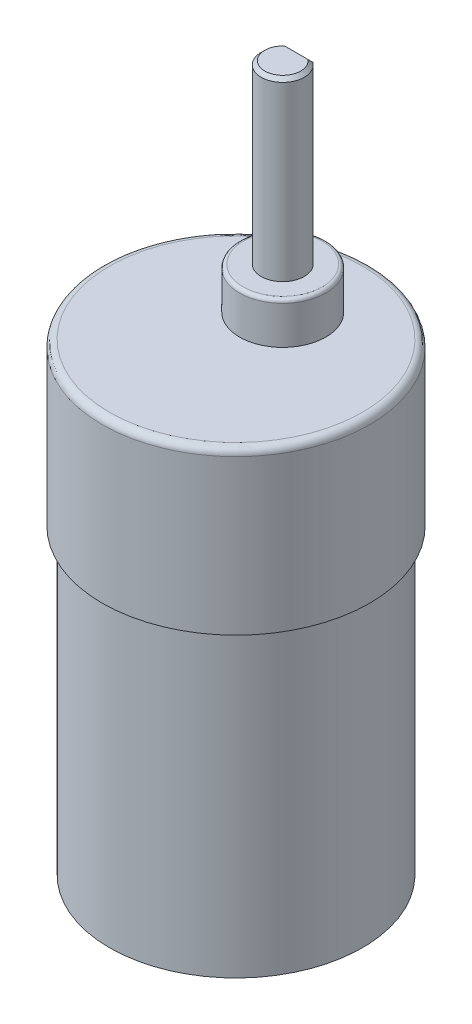
ISO-10303-21;
HEADER;
FILE_DESCRIPTION(('STEP AP214'),'2;1');
FILE_NAME('part.step','',(''),(''),'','','');
FILE_SCHEMA(('AUTOMOTIVE_DESIGN { 1 0 10303 214 1 1 1 1 }'));
ENDSEC;
DATA;
#1=APPLICATION_CONTEXT('core data for automotive mechanical design processes');
#2=APPLICATION_PROTOCOL_DEFINITION('international standard','automotive_design',2000,#1);
#3=PRODUCT_CONTEXT('',#1,'mechanical');
#4=PRODUCT('Part','Part','',(#3));
#5=PRODUCT_RELATED_PRODUCT_CATEGORY('part','',(#4));
#6=PRODUCT_DEFINITION_FORMATION('','',#4);
#7=PRODUCT_DEFINITION_CONTEXT('part definition',#1,'design');
#8=PRODUCT_DEFINITION('design','',#6,#7);
#9=PRODUCT_DEFINITION_SHAPE('','',#8);
#10=(LENGTH_UNIT() NAMED_UNIT(*) SI_UNIT(.MILLI.,.METRE.));
#11=(NAMED_UNIT(*) PLANE_ANGLE_UNIT() SI_UNIT($,.RADIAN.));
#12=(NAMED_UNIT(*) SI_UNIT($,.STERADIAN.) SOLID_ANGLE_UNIT());
#13=UNCERTAINTY_MEASURE_WITH_UNIT(LENGTH_MEASURE(1.E-05),#10,'distance_accuracy_value','');
#14=(GEOMETRIC_REPRESENTATION_CONTEXT(3) GLOBAL_UNCERTAINTY_ASSIGNED_CONTEXT((#13)) GLOBAL_UNIT_ASSIGNED_CONTEXT((#10,
#11,#12)) REPRESENTATION_CONTEXT('',''));
#15=CARTESIAN_POINT('',(0.,0.,0.));
#16=DIRECTION('',(0.,0.,1.));
#17=DIRECTION('',(1.,0.,0.));
#18=AXIS2_PLACEMENT_3D('',#15,#16,#17);
#19=CARTESIAN_POINT('',(0.,28.3,-6.5));
#20=DIRECTION('',(0.,1.,0.));
#21=DIRECTION('',(0.,0.,1.));
#22=AXIS2_PLACEMENT_3D('',#19,#20,#21);
#23=PLANE('',#22);
#24=CARTESIAN_POINT('',(0.,28.3,-6.5));
#25=DIRECTION('',(0.,-1.,0.));
#26=DIRECTION('',(0.,0.,1.));
#27=AXIS2_PLACEMENT_3D('',#24,#25,#26);
#28=CIRCLE('',#27,5.5);
#29=CARTESIAN_POINT('',(0.,28.3,-0.999999999999998));
#30=VERTEX_POINT('',#29);
#31=EDGE_CURVE('P0_E199',#30,#30,#28,.T.);
#32=ORIENTED_EDGE('',*,*,#31,.F.);
#33=EDGE_LOOP('',(#32));
#34=FACE_BOUND('',#33,.T.);
#35=ADVANCED_FACE('P0_F15',(#34),#23,.T.);
#36=CARTESIAN_POINT('',(0.,-44.7,0.));
#37=DIRECTION('',(0.,-1.,0.));
#38=DIRECTION('',(0.,0.,-1.));
#39=AXIS2_PLACEMENT_3D('',#36,#37,#38);
#40=PLANE('',#39);
#41=CARTESIAN_POINT('',(0.,-44.7,0.));
#42=DIRECTION('',(0.,1.,0.));
#43=DIRECTION('',(0.,0.,-1.));
#44=AXIS2_PLACEMENT_3D('',#41,#42,#43);
#45=CIRCLE('',#44,2.9);
#46=CARTESIAN_POINT('',(0.,-44.7,-2.9));
#47=VERTEX_POINT('',#46);
#48=EDGE_CURVE('P0_E168',#47,#47,#45,.T.);
#49=ORIENTED_EDGE('',*,*,#48,.F.);
#50=EDGE_LOOP('',(#49));
#51=FACE_BOUND('',#50,.T.);
#52=ADVANCED_FACE('P0_F598',(#51),#40,.T.);
#53=CARTESIAN_POINT('',(0.,27.8,-6.5));
#54=DIRECTION('',(0.,1.,0.));
#55=DIRECTION('',(0.,0.,1.));
#56=AXIS2_PLACEMENT_3D('',#53,#54,#55);
#57=TOROIDAL_SURFACE('',#56,5.5,0.5);
#58=ORIENTED_EDGE('',*,*,#31,.T.);
#59=EDGE_LOOP('',(#58));
#60=FACE_BOUND('',#59,.T.);
#61=CARTESIAN_POINT('',(0.,27.8,-6.5));
#62=DIRECTION('',(0.,-1.,0.));
#63=DIRECTION('',(0.,0.,-1.));
#64=AXIS2_PLACEMENT_3D('',#61,#62,#63);
#65=CIRCLE('',#64,6.);
#66=CARTESIAN_POINT('',(0.,27.8,-12.5));
#67=VERTEX_POINT('',#66);
#68=EDGE_CURVE('P0_E139',#67,#67,#65,.T.);
#69=ORIENTED_EDGE('',*,*,#68,.F.);
#70=EDGE_LOOP('',(#69));
#71=FACE_BOUND('',#70,.T.);
#72=ADVANCED_FACE('P0_F179',(#60,#71),#57,.T.);
#73=CARTESIAN_POINT('',(0.,-42.7,0.));
#74=DIRECTION('',(0.,-1.,0.));
#75=DIRECTION('',(0.,0.,-1.));
#76=AXIS2_PLACEMENT_3D('',#73,#74,#75);
#77=TOROIDAL_SURFACE('',#76,2.9,2.);
#78=ORIENTED_EDGE('',*,*,#48,.T.);
#79=EDGE_LOOP('',(#78));
#80=FACE_BOUND('',#79,.T.);
#81=CARTESIAN_POINT('',(0.,-42.7,0.));
#82=DIRECTION('',(0.,1.,0.));
#83=DIRECTION('',(0.,0.,1.));
#84=AXIS2_PLACEMENT_3D('',#81,#82,#83);
#85=CIRCLE('',#84,4.9);
#86=CARTESIAN_POINT('',(0.,-42.7,4.9));
#87=VERTEX_POINT('',#86);
#88=EDGE_CURVE('P0_E123',#87,#87,#85,.T.);
#89=ORIENTED_EDGE('',*,*,#88,.F.);
#90=EDGE_LOOP('',(#89));
#91=FACE_BOUND('',#90,.T.);
#92=ADVANCED_FACE('P0_F174',(#80,#91),#77,.T.);
#93=CARTESIAN_POINT('',(9.50016722103489,-46.,-9.6182094503272));
#94=DIRECTION('',(-0.363581099345543,0.,0.931562549804728));
#95=DIRECTION('',(0.931562549804728,0.,0.363581099345543));
#96=AXIS2_PLACEMENT_3D('',#93,#94,#95);
#97=PLANE('',#96);
#98=DIRECTION('',(-0.931562549804728,0.,-0.363581099345544));
#99=VECTOR('',#98,1.);
#100=CARTESIAN_POINT('',(9.50016722103489,-45.5,-9.6182094503272));
#101=LINE('',#100,#99);
#102=CARTESIAN_POINT('',(9.50016722103489,-45.5,-9.6182094503272));
#103=VERTEX_POINT('',#102);
#104=CARTESIAN_POINT('',(9.03438594613245,-45.5,-9.8));
#105=VERTEX_POINT('',#104);
#106=EDGE_CURVE('P0_E108',#103,#105,#101,.T.);
#107=ORIENTED_EDGE('',*,*,#106,.T.);
#108=DIRECTION('',(0.,1.,0.));
#109=VECTOR('',#108,1.);
#110=CARTESIAN_POINT('',(9.03438594613245,-46.,-9.8));
#111=LINE('',#110,#109);
#112=CARTESIAN_POINT('',(9.03438594613245,-41.,-9.8));
#113=VERTEX_POINT('',#112);
#114=EDGE_CURVE('P0_E111',#105,#113,#111,.T.);
#115=ORIENTED_EDGE('',*,*,#114,.T.);
#116=DIRECTION('',(0.931562549804728,0.,0.363581099345543));
#117=VECTOR('',#116,1.);
#118=CARTESIAN_POINT('',(9.50016722103489,-41.,-9.6182094503272));
#119=LINE('',#118,#117);
#120=CARTESIAN_POINT('',(9.50016722103489,-41.,-9.6182094503272));
#121=VERTEX_POINT('',#120);
#122=EDGE_CURVE('P0_E116',#121,#113,#119,.F.);
#123=ORIENTED_EDGE('',*,*,#122,.F.);
#124=DIRECTION('',(0.,1.,0.));
#125=VECTOR('',#124,1.);
#126=CARTESIAN_POINT('',(9.50016722103489,-46.,-9.6182094503272));
#127=LINE('',#126,#125);
#128=EDGE_CURVE('P0_E114',#121,#103,#127,.F.);
#129=ORIENTED_EDGE('',*,*,#128,.T.);
#130=EDGE_LOOP('',(#107,#115,#123,#129));
#131=FACE_BOUND('',#130,.T.);
#132=ADVANCED_FACE('P0_F109',(#131),#97,.F.);
#133=CARTESIAN_POINT('',(8.8525953964609,-46.,-9.33421872509717));
#134=DIRECTION('',(-0.257090660858496,0.707106781186542,0.65871419606636));
#135=DIRECTION('',(0.,-0.681625476296494,0.731701243721491));
#136=AXIS2_PLACEMENT_3D('',#133,#134,#135);
#137=PLANE('',#136);
#138=ORIENTED_EDGE('',*,*,#106,.F.);
#139=DIRECTION('',(-0.257090660858222,-0.707106781186555,0.658714196066452));
#140=VECTOR('',#139,1.);
#141=CARTESIAN_POINT('',(9.50016722103489,-45.5,-9.6182094503272));
#142=LINE('',#141,#140);
#143=CARTESIAN_POINT('',(9.31837667136231,-46.,-9.15242817542477));
#144=VERTEX_POINT('',#143);
#145=EDGE_CURVE('P0_E266',#103,#144,#142,.T.);
#146=ORIENTED_EDGE('',*,*,#145,.T.);
#147=DIRECTION('',(-0.931562549804734,0.,-0.363581099345529));
#148=VECTOR('',#147,1.);
#149=CARTESIAN_POINT('',(9.31837667136231,-46.,-9.15242817542477));
#150=LINE('',#149,#148);
#151=CARTESIAN_POINT('',(8.85259539645988,-46.,-9.33421872509756));
#152=VERTEX_POINT('',#151);
#153=EDGE_CURVE('P0_E102',#144,#152,#150,.T.);
#154=ORIENTED_EDGE('',*,*,#153,.T.);
#155=DIRECTION('',(0.257090660858207,0.707106781186549,-0.658714196066464));
#156=VECTOR('',#155,1.);
#157=CARTESIAN_POINT('',(8.85259539645988,-46.,-9.33421872509756));
#158=LINE('',#157,#156);
#159=EDGE_CURVE('P0_E119',#152,#105,#158,.T.);
#160=ORIENTED_EDGE('',*,*,#159,.T.);
#161=EDGE_LOOP('',(#138,#146,#154,#160));
#162=FACE_BOUND('',#161,.T.);
#163=ADVANCED_FACE('P0_F120',(#162),#137,.F.);
#164=CARTESIAN_POINT('',(7.94364264809696,-46.,-7.00531235058515));
#165=DIRECTION('',(0.,1.,0.));
#166=DIRECTION('',(0.,0.,1.));
#167=AXIS2_PLACEMENT_3D('',#164,#165,#166);
#168=PLANE('',#167);
#169=DIRECTION('',(-0.931562549804876,0.,-0.363581099345163));
#170=VECTOR('',#169,1.);
#171=CARTESIAN_POINT('',(8.59121447267197,-46.,-7.28930307581499));
#172=LINE('',#171,#170);
#173=CARTESIAN_POINT('',(8.59121447267197,-46.,-7.28930307581499));
#174=VERTEX_POINT('',#173);
#175=CARTESIAN_POINT('',(8.12543319776952,-46.,-7.47109362548758));
#176=VERTEX_POINT('',#175);
#177=EDGE_CURVE('P0_E164',#174,#176,#172,.T.);
#178=ORIENTED_EDGE('',*,*,#177,.T.);
#179=DIRECTION('',(0.363581099345139,0.,-0.931562549804886));
#180=VECTOR('',#179,1.);
#181=CARTESIAN_POINT('',(9.03438594613245,-46.,-9.8));
#182=LINE('',#181,#180);
#183=EDGE_CURVE('P0_E269',#176,#152,#182,.T.);
#184=ORIENTED_EDGE('',*,*,#183,.T.);
#185=ORIENTED_EDGE('',*,*,#153,.F.);
#186=DIRECTION('',(-0.363581099345163,0.,0.931562549804876));
#187=VECTOR('',#186,1.);
#188=CARTESIAN_POINT('',(8.4094239229994,-46.,-6.82352180091257));
#189=LINE('',#188,#187);
#190=EDGE_CURVE('P0_E261',#144,#174,#189,.T.);
#191=ORIENTED_EDGE('',*,*,#190,.T.);
#192=EDGE_LOOP('',(#178,#184,#185,#191));
#193=FACE_BOUND('',#192,.T.);
#194=ADVANCED_FACE('P0_F276',(#193),#168,.F.);
#195=CARTESIAN_POINT('',(8.12543319776954,-46.,-7.47109362548757));
#196=DIRECTION('',(0.257090660858227,0.707106781186538,-0.658714196066469));
#197=DIRECTION('',(0.,0.681625476296557,0.731701243721433));
#198=AXIS2_PLACEMENT_3D('',#195,#196,#197);
#199=PLANE('',#198);
#200=DIRECTION('',(-0.931562549804877,0.,-0.363581099345161));
#201=VECTOR('',#200,1.);
#202=CARTESIAN_POINT('',(7.94364264809696,-45.5,-7.00531235058515));
#203=LINE('',#202,#201);
#204=CARTESIAN_POINT('',(8.4094239229994,-45.5,-6.82352180091257));
#205=VERTEX_POINT('',#204);
#206=CARTESIAN_POINT('',(7.94364264809696,-45.5,-7.00531235058515));
#207=VERTEX_POINT('',#206);
#208=EDGE_CURVE('P0_E160',#205,#207,#203,.T.);
#209=ORIENTED_EDGE('',*,*,#208,.T.);
#210=DIRECTION('',(0.257090660858203,-0.707106781186558,-0.658714196066456));
#211=VECTOR('',#210,1.);
#212=CARTESIAN_POINT('',(7.94364264809696,-45.5,-7.00531235058515));
#213=LINE('',#212,#211);
#214=EDGE_CURVE('P0_E133',#207,#176,#213,.T.);
#215=ORIENTED_EDGE('',*,*,#214,.T.);
#216=ORIENTED_EDGE('',*,*,#177,.F.);
#217=DIRECTION('',(-0.257090660858219,0.707106781186562,0.658714196066445));
#218=VECTOR('',#217,1.);
#219=CARTESIAN_POINT('',(8.59121447267197,-46.,-7.28930307581499));
#220=LINE('',#219,#218);
#221=EDGE_CURVE('P0_E255',#174,#205,#220,.T.);
#222=ORIENTED_EDGE('',*,*,#221,.T.);
#223=EDGE_LOOP('',(#209,#215,#216,#222));
#224=FACE_BOUND('',#223,.T.);
#225=ADVANCED_FACE('P0_F273',(#224),#199,.F.);
#226=CARTESIAN_POINT('',(7.94364264809696,-46.,-7.00531235058515));
#227=DIRECTION('',(0.363581099345161,0.,-0.931562549804877));
#228=DIRECTION('',(-0.931562549804877,0.,-0.363581099345161));
#229=AXIS2_PLACEMENT_3D('',#226,#227,#228);
#230=PLANE('',#229);
#231=ORIENTED_EDGE('',*,*,#208,.F.);
#232=DIRECTION('',(0.,1.,0.));
#233=VECTOR('',#232,1.);
#234=CARTESIAN_POINT('',(8.4094239229994,-46.,-6.82352180091257));
#235=LINE('',#234,#233);
#236=CARTESIAN_POINT('',(8.4094239229994,-41.,-6.82352180091257));
#237=VERTEX_POINT('',#236);
#238=EDGE_CURVE('P0_E248',#205,#237,#235,.T.);
#239=ORIENTED_EDGE('',*,*,#238,.T.);
#240=DIRECTION('',(-0.931562549804877,0.,-0.363581099345161));
#241=VECTOR('',#240,1.);
#242=CARTESIAN_POINT('',(7.94364264809696,-41.,-7.00531235058515));
#243=LINE('',#242,#241);
#244=CARTESIAN_POINT('',(7.94364264809696,-41.,-7.00531235058515));
#245=VERTEX_POINT('',#244);
#246=EDGE_CURVE('P0_E162',#245,#237,#243,.F.);
#247=ORIENTED_EDGE('',*,*,#246,.F.);
#248=DIRECTION('',(0.,1.,0.));
#249=VECTOR('',#248,1.);
#250=CARTESIAN_POINT('',(7.94364264809696,-46.,-7.00531235058515));
#251=LINE('',#250,#249);
#252=EDGE_CURVE('P0_E130',#245,#207,#251,.F.);
#253=ORIENTED_EDGE('',*,*,#252,.T.);
#254=EDGE_LOOP('',(#231,#239,#247,#253));
#255=FACE_BOUND('',#254,.T.);
#256=ADVANCED_FACE('P0_F280',(#255),#230,.F.);
#257=CARTESIAN_POINT('',(26.4091766207759,-45.,-1.40856617087501));
#258=DIRECTION('',(-0.931562549804886,0.,-0.363581099345139));
#259=DIRECTION('',(-0.363581099345139,0.,0.931562549804886));
#260=AXIS2_PLACEMENT_3D('',#257,#258,#259);
#261=CYLINDRICAL_SURFACE('',#260,0.500000000000004);
#262=CARTESIAN_POINT('',(8.95479557201717,-45.,-8.22086562561998));
#263=DIRECTION('',(-0.931562549804886,0.,-0.363581099345139));
#264=DIRECTION('',(-0.363581099345139,0.,0.931562549804886));
#265=AXIS2_PLACEMENT_3D('',#262,#263,#264);
#266=CIRCLE('',#265,0.500000000000004);
#267=CARTESIAN_POINT('',(8.77300502234459,-45.,-7.75508435071754));
#268=VERTEX_POINT('',#267);
#269=EDGE_CURVE('P0_E245',#268,#268,#266,.F.);
#270=ORIENTED_EDGE('',*,*,#269,.T.);
#271=EDGE_LOOP('',(#270));
#272=FACE_BOUND('',#271,.T.);
#273=CARTESIAN_POINT('',(8.48901429711467,-45.,-8.40265617529257));
#274=DIRECTION('',(-0.931562549804886,0.,-0.363581099345139));
#275=DIRECTION('',(-0.363581099345139,0.,0.931562549804886));
#276=AXIS2_PLACEMENT_3D('',#273,#274,#275);
#277=CIRCLE('',#276,0.500000000000004);
#278=CARTESIAN_POINT('',(8.30722374744209,-45.,-7.93687490039013));
#279=VERTEX_POINT('',#278);
#280=EDGE_CURVE('P0_E19',#279,#279,#277,.T.);
#281=ORIENTED_EDGE('',*,*,#280,.T.);
#282=EDGE_LOOP('',(#281));
#283=FACE_BOUND('',#282,.T.);
#284=ADVANCED_FACE('P0_F357',(#272,#283),#261,.F.);
#285=CARTESIAN_POINT('',(-8.8525953964601,-46.,-9.33421872509732));
#286=DIRECTION('',(-0.257090660858267,-0.707106781186541,-0.658714196066449));
#287=DIRECTION('',(0.,0.681625476296544,-0.731701243721445));
#288=AXIS2_PLACEMENT_3D('',#285,#286,#287);
#289=PLANE('',#288);
#290=DIRECTION('',(0.25709066085822,-0.707106781186564,0.658714196066443));
#291=VECTOR('',#290,1.);
#292=CARTESIAN_POINT('',(-9.03438594613254,-45.5,-9.79999999999979));
#293=LINE('',#292,#291);
#294=CARTESIAN_POINT('',(-9.03438594613253,-45.5,-9.79999999999979));
#295=VERTEX_POINT('',#294);
#296=CARTESIAN_POINT('',(-8.85259539645996,-46.,-9.33421872509737));
#297=VERTEX_POINT('',#296);
#298=EDGE_CURVE('P0_E252',#295,#297,#293,.T.);
#299=ORIENTED_EDGE('',*,*,#298,.T.);
#300=DIRECTION('',(0.931562549804854,0.,-0.36358109934522));
#301=VECTOR('',#300,1.);
#302=CARTESIAN_POINT('',(-9.31837667136239,-46.,-9.15242817542476));
#303=LINE('',#302,#301);
#304=CARTESIAN_POINT('',(-9.31837667136239,-46.,-9.15242817542476));
#305=VERTEX_POINT('',#304);
#306=EDGE_CURVE('P0_E144',#305,#297,#303,.T.);
#307=ORIENTED_EDGE('',*,*,#306,.F.);
#308=DIRECTION('',(-0.257090660858219,0.707106781186562,-0.658714196066445));
#309=VECTOR('',#308,1.);
#310=CARTESIAN_POINT('',(-9.31837667136239,-46.,-9.15242817542476));
#311=LINE('',#310,#309);
#312=CARTESIAN_POINT('',(-9.50016722103496,-45.5,-9.61820945032718));
#313=VERTEX_POINT('',#312);
#314=EDGE_CURVE('P0_E243',#305,#313,#311,.T.);
#315=ORIENTED_EDGE('',*,*,#314,.T.);
#316=DIRECTION('',(0.931562549804854,0.,-0.36358109934522));
#317=VECTOR('',#316,1.);
#318=CARTESIAN_POINT('',(-9.03438594613253,-45.5,-9.79999999999979));
#319=LINE('',#318,#317);
#320=EDGE_CURVE('P0_E157',#313,#295,#319,.T.);
#321=ORIENTED_EDGE('',*,*,#320,.T.);
#322=EDGE_LOOP('',(#299,#307,#315,#321));
#323=FACE_BOUND('',#322,.T.);
#324=ADVANCED_FACE('P0_F353',(#323),#289,.T.);
#325=CARTESIAN_POINT('',(-9.03438594613253,-46.,-9.79999999999979));
#326=DIRECTION('',(0.36358109934522,0.,0.931562549804854));
#327=DIRECTION('',(0.931562549804854,0.,-0.36358109934522));
#328=AXIS2_PLACEMENT_3D('',#325,#326,#327);
#329=PLANE('',#328);
#330=ORIENTED_EDGE('',*,*,#320,.F.);
#331=DIRECTION('',(0.,1.,0.));
#332=VECTOR('',#331,1.);
#333=CARTESIAN_POINT('',(-9.50016722103496,-46.,-9.61820945032718));
#334=LINE('',#333,#332);
#335=CARTESIAN_POINT('',(-9.50016722103496,-41.,-9.61820945032718));
#336=VERTEX_POINT('',#335);
#337=EDGE_CURVE('P0_E415',#313,#336,#334,.T.);
#338=ORIENTED_EDGE('',*,*,#337,.T.);
#339=DIRECTION('',(0.931562549804854,0.,-0.36358109934522));
#340=VECTOR('',#339,1.);
#341=CARTESIAN_POINT('',(-9.03438594613253,-41.,-9.79999999999979));
#342=LINE('',#341,#340);
#343=CARTESIAN_POINT('',(-9.03438594613253,-41.,-9.79999999999979));
#344=VERTEX_POINT('',#343);
#345=EDGE_CURVE('P0_E34',#344,#336,#342,.F.);
#346=ORIENTED_EDGE('',*,*,#345,.F.);
#347=DIRECTION('',(0.,1.,0.));
#348=VECTOR('',#347,1.);
#349=CARTESIAN_POINT('',(-9.03438594613254,-46.,-9.79999999999979));
#350=LINE('',#349,#348);
#351=EDGE_CURVE('P0_E247',#344,#295,#350,.F.);
#352=ORIENTED_EDGE('',*,*,#351,.T.);
#353=EDGE_LOOP('',(#330,#338,#346,#352));
#354=FACE_BOUND('',#353,.T.);
#355=ADVANCED_FACE('P0_F349',(#354),#329,.F.);
#356=CARTESIAN_POINT('',(-8.40942392299948,-46.,-6.82352180091257));
#357=DIRECTION('',(-0.363581099345165,0.,-0.931562549804876));
#358=DIRECTION('',(-0.931562549804876,0.,0.363581099345165));
#359=AXIS2_PLACEMENT_3D('',#356,#357,#358);
#360=PLANE('',#359);
#361=DIRECTION('',(-0.931562549804876,0.,0.363581099345164));
#362=VECTOR('',#361,1.);
#363=CARTESIAN_POINT('',(-7.94364264809704,-45.5,-7.00531235058516));
#364=LINE('',#363,#362);
#365=CARTESIAN_POINT('',(-7.94364264809704,-45.5,-7.00531235058515));
#366=VERTEX_POINT('',#365);
#367=CARTESIAN_POINT('',(-8.40942392299948,-45.5,-6.82352180091257));
#368=VERTEX_POINT('',#367);
#369=EDGE_CURVE('P0_E152',#366,#368,#364,.T.);
#370=ORIENTED_EDGE('',*,*,#369,.F.);
#371=DIRECTION('',(0.,1.,0.));
#372=VECTOR('',#371,1.);
#373=CARTESIAN_POINT('',(-7.94364264809704,-46.,-7.00531235058515));
#374=LINE('',#373,#372);
#375=CARTESIAN_POINT('',(-7.94364264809704,-41.,-7.00531235058515));
#376=VERTEX_POINT('',#375);
#377=EDGE_CURVE('P0_E244',#366,#376,#374,.T.);
#378=ORIENTED_EDGE('',*,*,#377,.T.);
#379=DIRECTION('',(-0.931562549804876,0.,0.363581099345165));
#380=VECTOR('',#379,1.);
#381=CARTESIAN_POINT('',(-8.40942392299948,-41.,-6.82352180091257));
#382=LINE('',#381,#380);
#383=CARTESIAN_POINT('',(-8.40942392299948,-41.,-6.82352180091257));
#384=VERTEX_POINT('',#383);
#385=EDGE_CURVE('P0_E155',#384,#376,#382,.F.);
#386=ORIENTED_EDGE('',*,*,#385,.F.);
#387=DIRECTION('',(0.,1.,0.));
#388=VECTOR('',#387,1.);
#389=CARTESIAN_POINT('',(-8.40942392299947,-46.,-6.82352180091257));
#390=LINE('',#389,#388);
#391=EDGE_CURVE('P0_E419',#384,#368,#390,.F.);
#392=ORIENTED_EDGE('',*,*,#391,.T.);
#393=EDGE_LOOP('',(#370,#378,#386,#392));
#394=FACE_BOUND('',#393,.T.);
#395=ADVANCED_FACE('P0_F345',(#394),#360,.F.);
#396=CARTESIAN_POINT('',(-8.12543319776962,-46.,-7.47109362548759));
#397=DIRECTION('',(0.257090660858227,-0.707106781186543,0.658714196066462));
#398=DIRECTION('',(0.,-0.68162547629655,-0.731701243721439));
#399=AXIS2_PLACEMENT_3D('',#396,#397,#398);
#400=PLANE('',#399);
#401=DIRECTION('',(-0.257090660858223,-0.707106781186553,-0.658714196066453));
#402=VECTOR('',#401,1.);
#403=CARTESIAN_POINT('',(-8.40942392299947,-45.5,-6.82352180091257));
#404=LINE('',#403,#402);
#405=CARTESIAN_POINT('',(-8.59121447267206,-46.,-7.289303075815));
#406=VERTEX_POINT('',#405);
#407=EDGE_CURVE('P0_E424',#368,#406,#404,.T.);
#408=ORIENTED_EDGE('',*,*,#407,.T.);
#409=DIRECTION('',(-0.931562549804871,0.,0.363581099345177));
#410=VECTOR('',#409,1.);
#411=CARTESIAN_POINT('',(-8.12543319776962,-46.,-7.47109362548759));
#412=LINE('',#411,#410);
#413=CARTESIAN_POINT('',(-8.12543319776962,-46.,-7.47109362548759));
#414=VERTEX_POINT('',#413);
#415=EDGE_CURVE('P0_E149',#414,#406,#412,.T.);
#416=ORIENTED_EDGE('',*,*,#415,.F.);
#417=DIRECTION('',(0.257090660858226,0.707106781186547,0.658714196066459));
#418=VECTOR('',#417,1.);
#419=CARTESIAN_POINT('',(-8.12543319776962,-46.,-7.47109362548759));
#420=LINE('',#419,#418);
#421=EDGE_CURVE('P0_E431',#414,#366,#420,.T.);
#422=ORIENTED_EDGE('',*,*,#421,.T.);
#423=ORIENTED_EDGE('',*,*,#369,.T.);
#424=EDGE_LOOP('',(#408,#416,#422,#423));
#425=FACE_BOUND('',#424,.T.);
#426=ADVANCED_FACE('P0_F341',(#425),#400,.T.);
#427=CARTESIAN_POINT('',(-7.94364264809704,-46.,-7.00531235058515));
#428=DIRECTION('',(0.,-1.,0.));
#429=DIRECTION('',(0.,0.,-1.));
#430=AXIS2_PLACEMENT_3D('',#427,#428,#429);
#431=PLANE('',#430);
#432=DIRECTION('',(-0.363581099345165,0.,-0.931562549804876));
#433=VECTOR('',#432,1.);
#434=CARTESIAN_POINT('',(-9.50016722103496,-46.,-9.61820945032718));
#435=LINE('',#434,#433);
#436=EDGE_CURVE('P0_E240',#406,#305,#435,.T.);
#437=ORIENTED_EDGE('',*,*,#436,.T.);
#438=ORIENTED_EDGE('',*,*,#306,.T.);
#439=DIRECTION('',(0.363581099345165,0.,0.931562549804876));
#440=VECTOR('',#439,1.);
#441=CARTESIAN_POINT('',(-7.94364264809704,-46.,-7.00531235058515));
#442=LINE('',#441,#440);
#443=EDGE_CURVE('P0_E434',#297,#414,#442,.T.);
#444=ORIENTED_EDGE('',*,*,#443,.T.);
#445=ORIENTED_EDGE('',*,*,#415,.T.);
#446=EDGE_LOOP('',(#437,#438,#444,#445));
#447=FACE_BOUND('',#446,.T.);
#448=ADVANCED_FACE('P0_F337',(#447),#431,.T.);
#449=CARTESIAN_POINT('',(-26.4091766207762,-45.,-1.40856617087424));
#450=DIRECTION('',(0.931562549804876,0.,-0.363581099345165));
#451=DIRECTION('',(-0.363581099345165,0.,-0.931562549804876));
#452=AXIS2_PLACEMENT_3D('',#449,#450,#451);
#453=CYLINDRICAL_SURFACE('',#452,0.500000000000001);
#454=CARTESIAN_POINT('',(-8.95479557201722,-45.,-8.22086562561987));
#455=DIRECTION('',(0.931562549804876,0.,-0.363581099345165));
#456=DIRECTION('',(-0.363581099345165,0.,-0.931562549804876));
#457=AXIS2_PLACEMENT_3D('',#454,#455,#456);
#458=CIRCLE('',#457,0.500000000000001);
#459=CARTESIAN_POINT('',(-9.13658612168981,-45.,-8.68664690052231));
#460=VERTEX_POINT('',#459);
#461=EDGE_CURVE('P0_E237',#460,#460,#458,.F.);
#462=ORIENTED_EDGE('',*,*,#461,.T.);
#463=EDGE_LOOP('',(#462));
#464=FACE_BOUND('',#463,.T.);
#465=CARTESIAN_POINT('',(-8.48901429711477,-45.,-8.40265617529246));
#466=DIRECTION('',(0.931562549804876,0.,-0.363581099345165));
#467=DIRECTION('',(-0.363581099345165,0.,-0.931562549804876));
#468=AXIS2_PLACEMENT_3D('',#465,#466,#467);
#469=CIRCLE('',#468,0.500000000000001);
#470=CARTESIAN_POINT('',(-8.67080484678736,-45.,-8.86843745019489));
#471=VERTEX_POINT('',#470);
#472=EDGE_CURVE('P0_E241',#471,#471,#469,.T.);
#473=ORIENTED_EDGE('',*,*,#472,.T.);
#474=EDGE_LOOP('',(#473));
#475=FACE_BOUND('',#474,.T.);
#476=ADVANCED_FACE('P0_F333',(#464,#475),#453,.F.);
#477=CARTESIAN_POINT('',(0.,28.3,-6.5));
#478=DIRECTION('',(0.,-1.,0.));
#479=DIRECTION('',(0.,0.,-1.));
#480=AXIS2_PLACEMENT_3D('',#477,#478,#479);
#481=CYLINDRICAL_SURFACE('',#480,6.);
#482=CARTESIAN_POINT('',(0.,22.5,-6.5));
#483=DIRECTION('',(0.,-1.,0.));
#484=DIRECTION('',(0.,0.,-1.));
#485=AXIS2_PLACEMENT_3D('',#482,#483,#484);
#486=CIRCLE('',#485,6.);
#487=CARTESIAN_POINT('',(0.,22.5,-12.5));
#488=VERTEX_POINT('',#487);
#489=EDGE_CURVE('P0_E234',#488,#488,#486,.T.);
#490=ORIENTED_EDGE('',*,*,#489,.F.);
#491=EDGE_LOOP('',(#490));
#492=FACE_BOUND('',#491,.T.);
#493=ORIENTED_EDGE('',*,*,#68,.T.);
#494=EDGE_LOOP('',(#493));
#495=FACE_BOUND('',#494,.T.);
#496=ADVANCED_FACE('P0_F329',(#492,#495),#481,.T.);
#497=CARTESIAN_POINT('',(0.,-44.7,0.));
#498=DIRECTION('',(0.,1.,0.));
#499=DIRECTION('',(0.,0.,1.));
#500=AXIS2_PLACEMENT_3D('',#497,#498,#499);
#501=CYLINDRICAL_SURFACE('',#500,4.9);
#502=CARTESIAN_POINT('',(0.,-41.,0.));
#503=DIRECTION('',(0.,1.,0.));
#504=DIRECTION('',(0.,0.,1.));
#505=AXIS2_PLACEMENT_3D('',#502,#503,#504);
#506=CIRCLE('',#505,4.9);
#507=CARTESIAN_POINT('',(0.,-41.,4.9));
#508=VERTEX_POINT('',#507);
#509=EDGE_CURVE('P0_E231',#508,#508,#506,.T.);
#510=ORIENTED_EDGE('',*,*,#509,.F.);
#511=EDGE_LOOP('',(#510));
#512=FACE_BOUND('',#511,.T.);
#513=ORIENTED_EDGE('',*,*,#88,.T.);
#514=EDGE_LOOP('',(#513));
#515=FACE_BOUND('',#514,.T.);
#516=ADVANCED_FACE('P0_F325',(#512,#515),#501,.T.);
#517=CARTESIAN_POINT('',(9.03438594613245,-46.,-9.8));
#518=DIRECTION('',(0.931562549804886,0.,0.363581099345139));
#519=DIRECTION('',(0.363581099345139,0.,-0.931562549804886));
#520=AXIS2_PLACEMENT_3D('',#517,#518,#519);
#521=PLANE('',#520);
#522=ORIENTED_EDGE('',*,*,#280,.F.);
#523=EDGE_LOOP('',(#522));
#524=FACE_BOUND('',#523,.T.);
#525=ORIENTED_EDGE('',*,*,#214,.F.);
#526=ORIENTED_EDGE('',*,*,#252,.F.);
#527=DIRECTION('',(-0.363581099345138,0.,0.931562549804886));
#528=VECTOR('',#527,1.);
#529=CARTESIAN_POINT('',(9.03438594613245,-41.,-9.8));
#530=LINE('',#529,#528);
#531=EDGE_CURVE('P0_E129',#113,#245,#530,.T.);
#532=ORIENTED_EDGE('',*,*,#531,.F.);
#533=ORIENTED_EDGE('',*,*,#114,.F.);
#534=ORIENTED_EDGE('',*,*,#159,.F.);
#535=ORIENTED_EDGE('',*,*,#183,.F.);
#536=EDGE_LOOP('',(#525,#526,#532,#533,#534,#535));
#537=FACE_BOUND('',#536,.T.);
#538=ADVANCED_FACE('P0_F126',(#524,#537),#521,.F.);
#539=CARTESIAN_POINT('',(8.4094239229994,-46.,-6.82352180091257));
#540=DIRECTION('',(-0.931562549804876,0.,-0.363581099345163));
#541=DIRECTION('',(-0.363581099345163,0.,0.931562549804876));
#542=AXIS2_PLACEMENT_3D('',#539,#540,#541);
#543=PLANE('',#542);
#544=ORIENTED_EDGE('',*,*,#269,.F.);
#545=EDGE_LOOP('',(#544));
#546=FACE_BOUND('',#545,.T.);
#547=ORIENTED_EDGE('',*,*,#221,.F.);
#548=ORIENTED_EDGE('',*,*,#190,.F.);
#549=ORIENTED_EDGE('',*,*,#145,.F.);
#550=ORIENTED_EDGE('',*,*,#128,.F.);
#551=DIRECTION('',(0.363581099345163,0.,-0.931562549804876));
#552=VECTOR('',#551,1.);
#553=CARTESIAN_POINT('',(8.4094239229994,-41.,-6.82352180091257));
#554=LINE('',#553,#552);
#555=EDGE_CURVE('P0_E285',#237,#121,#554,.T.);
#556=ORIENTED_EDGE('',*,*,#555,.F.);
#557=ORIENTED_EDGE('',*,*,#238,.F.);
#558=EDGE_LOOP('',(#547,#548,#549,#550,#556,#557));
#559=FACE_BOUND('',#558,.T.);
#560=ADVANCED_FACE('P0_F279',(#546,#559),#543,.F.);
#561=CARTESIAN_POINT('',(-7.94364264809704,-46.,-7.00531235058515));
#562=DIRECTION('',(-0.931562549804876,0.,0.363581099345165));
#563=DIRECTION('',(0.363581099345165,0.,0.931562549804876));
#564=AXIS2_PLACEMENT_3D('',#561,#562,#563);
#565=PLANE('',#564);
#566=ORIENTED_EDGE('',*,*,#472,.F.);
#567=EDGE_LOOP('',(#566));
#568=FACE_BOUND('',#567,.T.);
#569=ORIENTED_EDGE('',*,*,#421,.F.);
#570=ORIENTED_EDGE('',*,*,#443,.F.);
#571=ORIENTED_EDGE('',*,*,#298,.F.);
#572=ORIENTED_EDGE('',*,*,#351,.F.);
#573=DIRECTION('',(-0.363581099345162,0.,-0.931562549804877));
#574=VECTOR('',#573,1.);
#575=CARTESIAN_POINT('',(-7.94364264809704,-41.,-7.00531235058515));
#576=LINE('',#575,#574);
#577=EDGE_CURVE('P0_E287',#376,#344,#576,.T.);
#578=ORIENTED_EDGE('',*,*,#577,.F.);
#579=ORIENTED_EDGE('',*,*,#377,.F.);
#580=EDGE_LOOP('',(#569,#570,#571,#572,#578,#579));
#581=FACE_BOUND('',#580,.T.);
#582=ADVANCED_FACE('P0_F315',(#568,#581),#565,.F.);
#583=CARTESIAN_POINT('',(-9.50016722103496,-46.,-9.61820945032718));
#584=DIRECTION('',(0.931562549804876,0.,-0.363581099345165));
#585=DIRECTION('',(-0.363581099345165,0.,-0.931562549804876));
#586=AXIS2_PLACEMENT_3D('',#583,#584,#585);
#587=PLANE('',#586);
#588=ORIENTED_EDGE('',*,*,#461,.F.);
#589=EDGE_LOOP('',(#588));
#590=FACE_BOUND('',#589,.T.);
#591=ORIENTED_EDGE('',*,*,#407,.F.);
#592=ORIENTED_EDGE('',*,*,#391,.F.);
#593=DIRECTION('',(0.363581099345164,0.,0.931562549804876));
#594=VECTOR('',#593,1.);
#595=CARTESIAN_POINT('',(-9.50016722103496,-41.,-9.61820945032717));
#596=LINE('',#595,#594);
#597=EDGE_CURVE('P0_E404',#336,#384,#596,.T.);
#598=ORIENTED_EDGE('',*,*,#597,.F.);
#599=ORIENTED_EDGE('',*,*,#337,.F.);
#600=ORIENTED_EDGE('',*,*,#314,.F.);
#601=ORIENTED_EDGE('',*,*,#436,.F.);
#602=EDGE_LOOP('',(#591,#592,#598,#599,#600,#601));
#603=FACE_BOUND('',#602,.T.);
#604=ADVANCED_FACE('P0_F310',(#590,#603),#587,.F.);
#605=CARTESIAN_POINT('',(0.,22.5,0.));
#606=DIRECTION('',(0.,1.,0.));
#607=DIRECTION('',(0.,0.,1.));
#608=AXIS2_PLACEMENT_3D('',#605,#606,#607);
#609=PLANE('',#608);
#610=ORIENTED_EDGE('',*,*,#489,.T.);
#611=EDGE_LOOP('',(#610));
#612=FACE_BOUND('',#611,.T.);
#613=CARTESIAN_POINT('',(0.,22.5,0.));
#614=DIRECTION('',(0.,-1.,0.));
#615=DIRECTION('',(0.,0.,1.));
#616=AXIS2_PLACEMENT_3D('',#613,#614,#615);
#617=CIRCLE('',#616,17.6);
#618=CARTESIAN_POINT('',(0.,22.5,17.6));
#619=VERTEX_POINT('',#618);
#620=EDGE_CURVE('P0_E230',#619,#619,#617,.T.);
#621=ORIENTED_EDGE('',*,*,#620,.F.);
#622=EDGE_LOOP('',(#621));
#623=FACE_BOUND('',#622,.T.);
#624=ADVANCED_FACE('P0_F300',(#612,#623),#609,.T.);
#625=CARTESIAN_POINT('',(0.,-41.,0.));
#626=DIRECTION('',(0.,-1.,0.));
#627=DIRECTION('',(0.,0.,-1.));
#628=AXIS2_PLACEMENT_3D('',#625,#626,#627);
#629=PLANE('',#628);
#630=ORIENTED_EDGE('',*,*,#345,.T.);
#631=ORIENTED_EDGE('',*,*,#597,.T.);
#632=ORIENTED_EDGE('',*,*,#385,.T.);
#633=ORIENTED_EDGE('',*,*,#577,.T.);
#634=EDGE_LOOP('',(#630,#631,#632,#633));
#635=FACE_BOUND('',#634,.T.);
#636=ORIENTED_EDGE('',*,*,#246,.T.);
#637=ORIENTED_EDGE('',*,*,#555,.T.);
#638=ORIENTED_EDGE('',*,*,#122,.T.);
#639=ORIENTED_EDGE('',*,*,#531,.T.);
#640=EDGE_LOOP('',(#636,#637,#638,#639));
#641=FACE_BOUND('',#640,.T.);
#642=ORIENTED_EDGE('',*,*,#509,.T.);
#643=EDGE_LOOP('',(#642));
#644=FACE_BOUND('',#643,.T.);
#645=CARTESIAN_POINT('',(0.,-41.,0.));
#646=DIRECTION('',(0.,-1.,0.));
#647=DIRECTION('',(0.,0.,-1.));
#648=AXIS2_PLACEMENT_3D('',#645,#646,#647);
#649=CIRCLE('',#648,17.);
#650=CARTESIAN_POINT('',(0.,-41.,-17.));
#651=VERTEX_POINT('',#650);
#652=EDGE_CURVE('P0_E227',#651,#651,#649,.T.);
#653=ORIENTED_EDGE('',*,*,#652,.T.);
#654=EDGE_LOOP('',(#653));
#655=FACE_BOUND('',#654,.T.);
#656=ADVANCED_FACE('P0_F282',(#635,#641,#644,#655),#629,.T.);
#657=CARTESIAN_POINT('',(0.,21.5,0.));
#658=DIRECTION('',(0.,1.,0.));
#659=DIRECTION('',(0.,0.,1.));
#660=AXIS2_PLACEMENT_3D('',#657,#658,#659);
#661=TOROIDAL_SURFACE('',#660,17.6,1.);
#662=ORIENTED_EDGE('',*,*,#620,.T.);
#663=EDGE_LOOP('',(#662));
#664=FACE_BOUND('',#663,.T.);
#665=CARTESIAN_POINT('',(0.,21.5,0.));
#666=DIRECTION('',(0.,-1.,0.));
#667=DIRECTION('',(0.,0.,-1.));
#668=AXIS2_PLACEMENT_3D('',#665,#666,#667);
#669=CIRCLE('',#668,18.6);
#670=CARTESIAN_POINT('',(0.,21.5,-18.6));
#671=VERTEX_POINT('',#670);
#672=EDGE_CURVE('P0_E226',#671,#671,#669,.T.);
#673=ORIENTED_EDGE('',*,*,#672,.F.);
#674=EDGE_LOOP('',(#673));
#675=FACE_BOUND('',#674,.T.);
#676=ADVANCED_FACE('P0_F393',(#664,#675),#661,.T.);
#677=CARTESIAN_POINT('',(0.,-41.,0.));
#678=DIRECTION('',(0.,-1.,0.));
#679=DIRECTION('',(0.,0.,-1.));
#680=AXIS2_PLACEMENT_3D('',#677,#678,#679);
#681=CYLINDRICAL_SURFACE('',#680,17.);
#682=CARTESIAN_POINT('',(0.,-42.,0.));
#683=DIRECTION('',(0.,-1.,0.));
#684=DIRECTION('',(0.,0.,-1.));
#685=AXIS2_PLACEMENT_3D('',#682,#683,#684);
#686=CIRCLE('',#685,17.);
#687=CARTESIAN_POINT('',(0.,-42.,-17.));
#688=VERTEX_POINT('',#687);
#689=EDGE_CURVE('P0_E223',#688,#688,#686,.F.);
#690=ORIENTED_EDGE('',*,*,#689,.F.);
#691=EDGE_LOOP('',(#690));
#692=FACE_BOUND('',#691,.T.);
#693=ORIENTED_EDGE('',*,*,#652,.F.);
#694=EDGE_LOOP('',(#693));
#695=FACE_BOUND('',#694,.T.);
#696=ADVANCED_FACE('P0_F390',(#692,#695),#681,.F.);
#697=CARTESIAN_POINT('',(0.,22.5,0.));
#698=DIRECTION('',(0.,-1.,0.));
#699=DIRECTION('',(0.,0.,-1.));
#700=AXIS2_PLACEMENT_3D('',#697,#698,#699);
#701=CYLINDRICAL_SURFACE('',#700,18.6);
#702=CARTESIAN_POINT('',(0.,0.,0.));
#703=DIRECTION('',(0.,-1.,0.));
#704=DIRECTION('',(0.,0.,-1.));
#705=AXIS2_PLACEMENT_3D('',#702,#703,#704);
#706=CIRCLE('',#705,18.6);
#707=CARTESIAN_POINT('',(0.,0.,-18.6));
#708=VERTEX_POINT('',#707);
#709=EDGE_CURVE('P0_E220',#708,#708,#706,.F.);
#710=ORIENTED_EDGE('',*,*,#709,.T.);
#711=EDGE_LOOP('',(#710));
#712=FACE_BOUND('',#711,.T.);
#713=ORIENTED_EDGE('',*,*,#672,.T.);
#714=EDGE_LOOP('',(#713));
#715=FACE_BOUND('',#714,.T.);
#716=ADVANCED_FACE('P0_F386',(#712,#715),#701,.T.);
#717=CARTESIAN_POINT('',(0.,-42.,0.));
#718=DIRECTION('',(0.,-1.,0.));
#719=DIRECTION('',(0.,0.,-1.));
#720=AXIS2_PLACEMENT_3D('',#717,#718,#719);
#721=PLANE('',#720);
#722=ORIENTED_EDGE('',*,*,#689,.T.);
#723=EDGE_LOOP('',(#722));
#724=FACE_BOUND('',#723,.T.);
#725=CARTESIAN_POINT('',(0.,-42.,0.));
#726=DIRECTION('',(0.,1.,0.));
#727=DIRECTION('',(0.,0.,1.));
#728=AXIS2_PLACEMENT_3D('',#725,#726,#727);
#729=CIRCLE('',#728,17.6);
#730=CARTESIAN_POINT('',(0.,-42.,17.6));
#731=VERTEX_POINT('',#730);
#732=EDGE_CURVE('P0_E25',#731,#731,#729,.T.);
#733=ORIENTED_EDGE('',*,*,#732,.F.);
#734=EDGE_LOOP('',(#733));
#735=FACE_BOUND('',#734,.T.);
#736=ADVANCED_FACE('P0_F379',(#724,#735),#721,.T.);
#737=CARTESIAN_POINT('',(0.,0.,0.));
#738=DIRECTION('',(0.,1.,0.));
#739=DIRECTION('',(0.,0.,1.));
#740=AXIS2_PLACEMENT_3D('',#737,#738,#739);
#741=PLANE('',#740);
#742=CARTESIAN_POINT('',(0.,0.,0.));
#743=DIRECTION('',(0.,1.,0.));
#744=DIRECTION('',(0.,0.,1.));
#745=AXIS2_PLACEMENT_3D('',#742,#743,#744);
#746=CIRCLE('',#745,17.6);
#747=CARTESIAN_POINT('',(0.,0.,17.6));
#748=VERTEX_POINT('',#747);
#749=EDGE_CURVE('P0_E10',#748,#748,#746,.F.);
#750=ORIENTED_EDGE('',*,*,#749,.F.);
#751=EDGE_LOOP('',(#750));
#752=FACE_BOUND('',#751,.T.);
#753=ORIENTED_EDGE('',*,*,#709,.F.);
#754=EDGE_LOOP('',(#753));
#755=FACE_BOUND('',#754,.T.);
#756=ADVANCED_FACE('P0_F373',(#752,#755),#741,.F.);
#757=CARTESIAN_POINT('',(0.,-42.,0.));
#758=DIRECTION('',(0.,1.,0.));
#759=DIRECTION('',(0.,0.,1.));
#760=AXIS2_PLACEMENT_3D('',#757,#758,#759);
#761=CYLINDRICAL_SURFACE('',#760,17.6);
#762=ORIENTED_EDGE('',*,*,#749,.T.);
#763=EDGE_LOOP('',(#762));
#764=FACE_BOUND('',#763,.T.);
#765=ORIENTED_EDGE('',*,*,#732,.T.);
#766=EDGE_LOOP('',(#765));
#767=FACE_BOUND('',#766,.T.);
#768=ADVANCED_FACE('P0_F371',(#764,#767),#761,.T.);
#769=CLOSED_SHELL('',(#35,#52,#72,#92,#132,#163,#194,#225,#256,#284,#324,#355,#395,#426,#448,
#476,#496,#516,#538,#560,#582,#604,#624,#656,#676,#696,#716,#736,#756,#768));
#770=MANIFOLD_SOLID_BREP('P0_B1',#769);
#771=CARTESIAN_POINT('',(0.,52.8,-6.5));
#772=DIRECTION('',(0.,1.,0.));
#773=DIRECTION('',(0.,0.,1.));
#774=AXIS2_PLACEMENT_3D('',#771,#772,#773);
#775=PLANE('',#774);
#776=CARTESIAN_POINT('',(0.,52.7999999999906,-6.5));
#777=DIRECTION('',(0.,-1.,0.));
#778=DIRECTION('',(0.,0.,-1.));
#779=AXIS2_PLACEMENT_3D('',#776,#777,#778);
#780=CIRCLE('',#779,2.50000000001455);
#781=CARTESIAN_POINT('',(1.62480768094237,52.7999999999953,-8.4));
#782=VERTEX_POINT('',#781);
#783=CARTESIAN_POINT('',(-1.62480768094237,52.7999999999953,-8.4));
#784=VERTEX_POINT('',#783);
#785=EDGE_CURVE('P1_E56',#782,#784,#780,.T.);
#786=ORIENTED_EDGE('',*,*,#785,.F.);
#787=DIRECTION('',(1.,0.,0.));
#788=VECTOR('',#787,1.);
#789=CARTESIAN_POINT('',(0.,52.8,-8.4));
#790=LINE('',#789,#788);
#791=EDGE_CURVE('P1_E53',#784,#782,#790,.T.);
#792=ORIENTED_EDGE('',*,*,#791,.F.);
#793=EDGE_LOOP('',(#786,#792));
#794=FACE_BOUND('',#793,.T.);
#795=ADVANCED_FACE('P1_F16',(#794),#775,.T.);
#796=CARTESIAN_POINT('',(0.,52.8,-8.4));
#797=DIRECTION('',(0.,0.707106781186544,-0.707106781186551));
#798=DIRECTION('',(0.,0.707106781186551,0.707106781186544));
#799=AXIS2_PLACEMENT_3D('',#796,#797,#798);
#800=PLANE('',#799);
#801=CARTESIAN_POINT('',(-1.62480768093631,52.7999999999969,-8.4000000000031));
#802=CARTESIAN_POINT('',(-1.65541292898365,52.7169127929633,-8.48308720703667));
#803=CARTESIAN_POINT('',(-1.68531495796043,52.6337023873602,-8.56629761263982));
#804=CARTESIAN_POINT('',(-1.74371238853474,52.4670357191017,-8.73296428089832));
#805=CARTESIAN_POINT('',(-1.77220779924739,52.3835794580432,-8.81642054195676));
#806=CARTESIAN_POINT('',(-1.80000000000461,52.3000000000121,-8.89999999998789));
#807=B_SPLINE_CURVE_WITH_KNOTS('',3,(#801,#802,#803,#804,#805,#806),.UNSPECIFIED.,.F.,.F.,(4,2,
4),(0.,0.364250835062729,0.728499309407566),.UNSPECIFIED.);
#808=CARTESIAN_POINT('',(-1.8000000000023,52.3000000000061,-8.89999999999394));
#809=VERTEX_POINT('',#808);
#810=EDGE_CURVE('P1_E19',#784,#809,#807,.T.);
#811=ORIENTED_EDGE('',*,*,#810,.F.);
#812=ORIENTED_EDGE('',*,*,#791,.T.);
#813=CARTESIAN_POINT('',(1.80000000000461,52.3000000000121,-8.89999999998789));
#814=CARTESIAN_POINT('',(1.77220779924739,52.3835794580432,-8.81642054195676));
#815=CARTESIAN_POINT('',(1.74371238853474,52.4670357191017,-8.73296428089831));
#816=CARTESIAN_POINT('',(1.68531495796043,52.6337023873602,-8.56629761263982));
#817=CARTESIAN_POINT('',(1.65541292898365,52.7169127929633,-8.48308720703666));
#818=CARTESIAN_POINT('',(1.62480768093631,52.7999999999969,-8.4000000000031));
#819=B_SPLINE_CURVE_WITH_KNOTS('',3,(#813,#814,#815,#816,#817,#818),.UNSPECIFIED.,.F.,.F.,(4,2,
4),(0.,0.364248474344838,0.728499309407567),.UNSPECIFIED.);
#820=CARTESIAN_POINT('',(1.80000000000231,52.3000000000061,-8.89999999999394));
#821=VERTEX_POINT('',#820);
#822=EDGE_CURVE('P1_E66',#821,#782,#819,.T.);
#823=ORIENTED_EDGE('',*,*,#822,.F.);
#824=DIRECTION('',(1.,0.,0.));
#825=VECTOR('',#824,1.);
#826=CARTESIAN_POINT('',(-1.8,52.3,-8.9));
#827=LINE('',#826,#825);
#828=EDGE_CURVE('P1_E63',#821,#809,#827,.F.);
#829=ORIENTED_EDGE('',*,*,#828,.T.);
#830=EDGE_LOOP('',(#811,#812,#823,#829));
#831=FACE_BOUND('',#830,.T.);
#832=ADVANCED_FACE('P1_F61',(#831),#800,.T.);
#833=CARTESIAN_POINT('',(0.,52.3000000001161,-6.5));
#834=DIRECTION('',(0.,-1.,0.));
#835=DIRECTION('',(0.,0.,-1.));
#836=AXIS2_PLACEMENT_3D('',#833,#834,#835);
#837=CONICAL_SURFACE('',#836,2.99999999988904,0.785398163397448);
#838=ORIENTED_EDGE('',*,*,#822,.T.);
#839=ORIENTED_EDGE('',*,*,#785,.T.);
#840=ORIENTED_EDGE('',*,*,#810,.T.);
#841=CARTESIAN_POINT('',(0.,52.3,-6.5));
#842=DIRECTION('',(0.,-1.,0.));
#843=DIRECTION('',(0.,0.,-1.));
#844=AXIS2_PLACEMENT_3D('',#841,#842,#843);
#845=CIRCLE('',#844,3.);
#846=EDGE_CURVE('P1_E102',#821,#809,#845,.T.);
#847=ORIENTED_EDGE('',*,*,#846,.F.);
#848=EDGE_LOOP('',(#838,#839,#840,#847));
#849=FACE_BOUND('',#848,.T.);
#850=ADVANCED_FACE('P1_F67',(#849),#837,.T.);
#851=CARTESIAN_POINT('',(-1.8,52.8,-8.9));
#852=DIRECTION('',(0.,0.,1.));
#853=DIRECTION('',(1.,0.,0.));
#854=AXIS2_PLACEMENT_3D('',#851,#852,#853);
#855=PLANE('',#854);
#856=ORIENTED_EDGE('',*,*,#828,.F.);
#857=DIRECTION('',(0.,-1.,0.));
#858=VECTOR('',#857,1.);
#859=CARTESIAN_POINT('',(1.8,52.8,-8.9));
#860=LINE('',#859,#858);
#861=CARTESIAN_POINT('',(1.8,28.3,-8.9));
#862=VERTEX_POINT('',#861);
#863=EDGE_CURVE('P1_E100',#862,#821,#860,.F.);
#864=ORIENTED_EDGE('',*,*,#863,.F.);
#865=DIRECTION('',(1.,0.,0.));
#866=VECTOR('',#865,1.);
#867=CARTESIAN_POINT('',(0.,28.3,-8.9));
#868=LINE('',#867,#866);
#869=CARTESIAN_POINT('',(-1.8,28.3,-8.9));
#870=VERTEX_POINT('',#869);
#871=EDGE_CURVE('P1_E38',#862,#870,#868,.F.);
#872=ORIENTED_EDGE('',*,*,#871,.T.);
#873=DIRECTION('',(0.,-1.,0.));
#874=VECTOR('',#873,1.);
#875=CARTESIAN_POINT('',(-1.8,52.8,-8.9));
#876=LINE('',#875,#874);
#877=EDGE_CURVE('P1_E30',#809,#870,#876,.T.);
#878=ORIENTED_EDGE('',*,*,#877,.F.);
#879=EDGE_LOOP('',(#856,#864,#872,#878));
#880=FACE_BOUND('',#879,.T.);
#881=ADVANCED_FACE('P1_F84',(#880),#855,.F.);
#882=CARTESIAN_POINT('',(0.,28.3,-6.5));
#883=DIRECTION('',(0.,1.,0.));
#884=DIRECTION('',(0.,0.,1.));
#885=AXIS2_PLACEMENT_3D('',#882,#883,#884);
#886=PLANE('',#885);
#887=ORIENTED_EDGE('',*,*,#871,.F.);
#888=CARTESIAN_POINT('',(0.,28.3,-6.5));
#889=DIRECTION('',(0.,-1.,0.));
#890=DIRECTION('',(0.,0.,-1.));
#891=AXIS2_PLACEMENT_3D('',#888,#889,#890);
#892=CIRCLE('',#891,3.);
#893=EDGE_CURVE('P1_E11',#870,#862,#892,.F.);
#894=ORIENTED_EDGE('',*,*,#893,.F.);
#895=EDGE_LOOP('',(#887,#894));
#896=FACE_BOUND('',#895,.T.);
#897=ADVANCED_FACE('P1_F87',(#896),#886,.F.);
#898=CARTESIAN_POINT('',(0.,52.8,-6.5));
#899=DIRECTION('',(0.,-1.,0.));
#900=DIRECTION('',(0.,0.,-1.));
#901=AXIS2_PLACEMENT_3D('',#898,#899,#900);
#902=CYLINDRICAL_SURFACE('',#901,3.);
#903=ORIENTED_EDGE('',*,*,#877,.T.);
#904=ORIENTED_EDGE('',*,*,#893,.T.);
#905=ORIENTED_EDGE('',*,*,#863,.T.);
#906=ORIENTED_EDGE('',*,*,#846,.T.);
#907=EDGE_LOOP('',(#903,#904,#905,#906));
#908=FACE_BOUND('',#907,.T.);
#909=ADVANCED_FACE('P1_F85',(#908),#902,.T.);
#910=CLOSED_SHELL('',(#795,#832,#850,#881,#897,#909));
#911=MANIFOLD_SOLID_BREP('P1_B1',#910);
#912=ADVANCED_BREP_SHAPE_REPRESENTATION('',(#18,#770,#911),#14);
#913=SHAPE_DEFINITION_REPRESENTATION(#9,#912);
ENDSEC;
END-ISO-10303-21;
